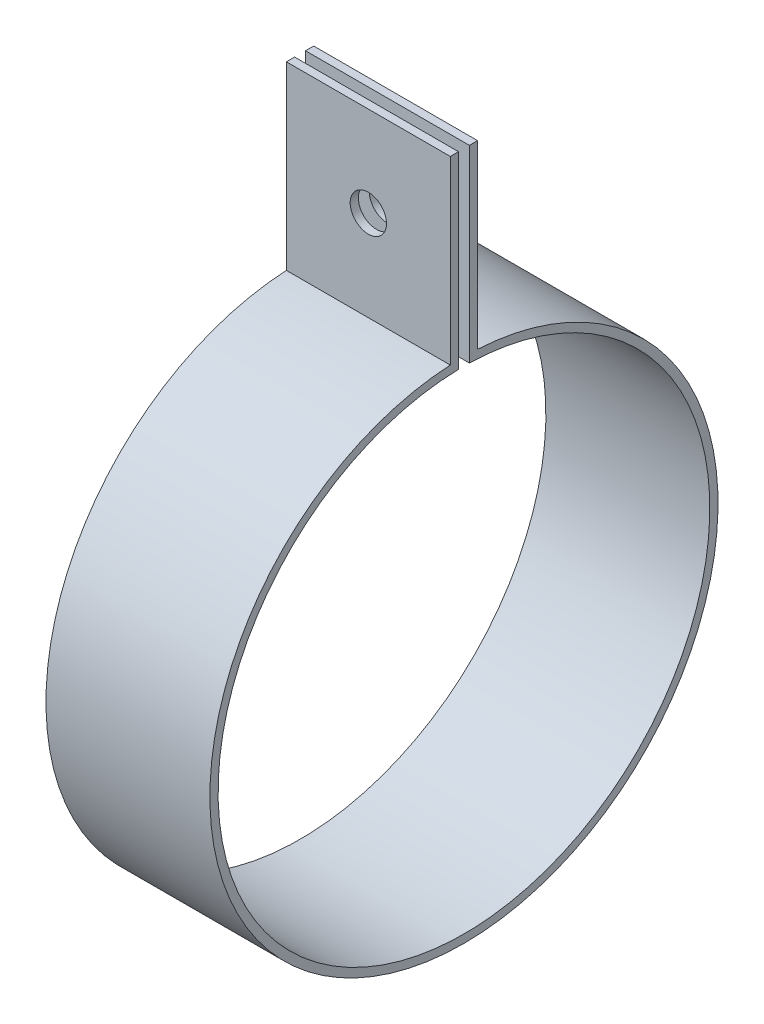
ISO-10303-21;
HEADER;
FILE_DESCRIPTION(('STEP AP214'),'2;1');
FILE_NAME('part.step','',(''),(''),'','','');
FILE_SCHEMA(('AUTOMOTIVE_DESIGN { 1 0 10303 214 1 1 1 1 }'));
ENDSEC;
DATA;
#1=APPLICATION_CONTEXT('core data for automotive mechanical design processes');
#2=APPLICATION_PROTOCOL_DEFINITION('international standard','automotive_design',2000,#1);
#3=PRODUCT_CONTEXT('',#1,'mechanical');
#4=PRODUCT('Part','Part','',(#3));
#5=PRODUCT_RELATED_PRODUCT_CATEGORY('part','',(#4));
#6=PRODUCT_DEFINITION_FORMATION('','',#4);
#7=PRODUCT_DEFINITION_CONTEXT('part definition',#1,'design');
#8=PRODUCT_DEFINITION('design','',#6,#7);
#9=PRODUCT_DEFINITION_SHAPE('','',#8);
#10=(LENGTH_UNIT() NAMED_UNIT(*) SI_UNIT(.MILLI.,.METRE.));
#11=(NAMED_UNIT(*) PLANE_ANGLE_UNIT() SI_UNIT($,.RADIAN.));
#12=(NAMED_UNIT(*) SI_UNIT($,.STERADIAN.) SOLID_ANGLE_UNIT());
#13=UNCERTAINTY_MEASURE_WITH_UNIT(LENGTH_MEASURE(1.E-05),#10,'distance_accuracy_value','');
#14=(GEOMETRIC_REPRESENTATION_CONTEXT(3) GLOBAL_UNCERTAINTY_ASSIGNED_CONTEXT((#13)) GLOBAL_UNIT_ASSIGNED_CONTEXT((#10,
#11,#12)) REPRESENTATION_CONTEXT('',''));
#15=CARTESIAN_POINT('',(0.,0.,0.));
#16=DIRECTION('',(0.,0.,1.));
#17=DIRECTION('',(1.,0.,0.));
#18=AXIS2_PLACEMENT_3D('',#15,#16,#17);
#19=CARTESIAN_POINT('',(0.,14.9925494902559,0.));
#20=DIRECTION('',(1.,0.,0.));
#21=DIRECTION('',(0.,1.,0.));
#22=AXIS2_PLACEMENT_3D('',#19,#20,#21);
#23=PLANE('',#22);
#24=DIRECTION('',(0.,0.,1.));
#25=VECTOR('',#24,1.);
#26=CARTESIAN_POINT('',(0.,79.5,1.));
#27=LINE('',#26,#25);
#28=CARTESIAN_POINT('',(0.,79.5,1.));
#29=VERTEX_POINT('',#28);
#30=CARTESIAN_POINT('',(0.,79.5,2.5));
#31=VERTEX_POINT('',#30);
#32=EDGE_CURVE('E27',#29,#31,#27,.T.);
#33=ORIENTED_EDGE('',*,*,#32,.F.);
#34=DIRECTION('',(0.,1.,0.));
#35=VECTOR('',#34,1.);
#36=CARTESIAN_POINT('',(0.,44.988887516808,1.));
#37=LINE('',#36,#35);
#38=CARTESIAN_POINT('',(0.,44.988887516808,1.));
#39=VERTEX_POINT('',#38);
#40=EDGE_CURVE('E140',#39,#29,#37,.T.);
#41=ORIENTED_EDGE('',*,*,#40,.F.);
#42=CARTESIAN_POINT('',(0.,0.,0.));
#43=DIRECTION('',(-1.,0.,0.));
#44=DIRECTION('',(0.,-1.,0.));
#45=AXIS2_PLACEMENT_3D('',#42,#43,#44);
#46=CIRCLE('',#45,45.);
#47=CARTESIAN_POINT('',(0.,44.988887516808,-1.));
#48=VERTEX_POINT('',#47);
#49=EDGE_CURVE('E164',#48,#39,#46,.T.);
#50=ORIENTED_EDGE('',*,*,#49,.F.);
#51=DIRECTION('',(0.,-1.,0.));
#52=VECTOR('',#51,1.);
#53=CARTESIAN_POINT('',(0.,79.5,-1.));
#54=LINE('',#53,#52);
#55=CARTESIAN_POINT('',(0.,79.5,-1.));
#56=VERTEX_POINT('',#55);
#57=EDGE_CURVE('E156',#56,#48,#54,.T.);
#58=ORIENTED_EDGE('',*,*,#57,.F.);
#59=DIRECTION('',(0.,0.,1.));
#60=VECTOR('',#59,1.);
#61=CARTESIAN_POINT('',(0.,79.5,-2.5));
#62=LINE('',#61,#60);
#63=CARTESIAN_POINT('',(0.,79.5,-2.5));
#64=VERTEX_POINT('',#63);
#65=EDGE_CURVE('E107',#64,#56,#62,.T.);
#66=ORIENTED_EDGE('',*,*,#65,.F.);
#67=DIRECTION('',(0.,1.,0.));
#68=VECTOR('',#67,1.);
#69=CARTESIAN_POINT('',(0.,46.4327470649756,-2.49999999999984));
#70=LINE('',#69,#68);
#71=CARTESIAN_POINT('',(0.,46.4327470649756,-2.49999999999984));
#72=VERTEX_POINT('',#71);
#73=EDGE_CURVE('E123',#72,#64,#70,.T.);
#74=ORIENTED_EDGE('',*,*,#73,.F.);
#75=CARTESIAN_POINT('',(0.,0.,0.));
#76=DIRECTION('',(1.,0.,0.));
#77=DIRECTION('',(0.,0.998553700322056,0.053763440860215));
#78=AXIS2_PLACEMENT_3D('',#75,#76,#77);
#79=CIRCLE('',#78,46.5);
#80=CARTESIAN_POINT('',(0.,46.4327470649756,2.5));
#81=VERTEX_POINT('',#80);
#82=EDGE_CURVE('E177',#81,#72,#79,.T.);
#83=ORIENTED_EDGE('',*,*,#82,.F.);
#84=DIRECTION('',(0.,-1.,0.));
#85=VECTOR('',#84,1.);
#86=CARTESIAN_POINT('',(0.,79.5,2.5));
#87=LINE('',#86,#85);
#88=EDGE_CURVE('E153',#31,#81,#87,.T.);
#89=ORIENTED_EDGE('',*,*,#88,.F.);
#90=EDGE_LOOP('',(#33,#41,#50,#58,#66,#74,#83,#89));
#91=FACE_BOUND('',#90,.T.);
#92=ADVANCED_FACE('F16',(#91),#23,.F.);
#93=CARTESIAN_POINT('',(30.,14.9925494902559,0.));
#94=DIRECTION('',(1.,0.,0.));
#95=DIRECTION('',(0.,1.,0.));
#96=AXIS2_PLACEMENT_3D('',#93,#94,#95);
#97=PLANE('',#96);
#98=DIRECTION('',(0.,0.,1.));
#99=VECTOR('',#98,1.);
#100=CARTESIAN_POINT('',(30.,79.5,1.));
#101=LINE('',#100,#99);
#102=CARTESIAN_POINT('',(30.,79.5,1.));
#103=VERTEX_POINT('',#102);
#104=CARTESIAN_POINT('',(30.,79.5,2.5));
#105=VERTEX_POINT('',#104);
#106=EDGE_CURVE('E11',#103,#105,#101,.T.);
#107=ORIENTED_EDGE('',*,*,#106,.T.);
#108=DIRECTION('',(0.,-1.,0.));
#109=VECTOR('',#108,1.);
#110=CARTESIAN_POINT('',(30.,79.5,2.5));
#111=LINE('',#110,#109);
#112=CARTESIAN_POINT('',(30.,46.4327470649756,2.5));
#113=VERTEX_POINT('',#112);
#114=EDGE_CURVE('E171',#105,#113,#111,.T.);
#115=ORIENTED_EDGE('',*,*,#114,.T.);
#116=CARTESIAN_POINT('',(30.,0.,0.));
#117=DIRECTION('',(1.,0.,0.));
#118=DIRECTION('',(0.,0.998553700322056,0.053763440860215));
#119=AXIS2_PLACEMENT_3D('',#116,#117,#118);
#120=CIRCLE('',#119,46.5);
#121=CARTESIAN_POINT('',(30.,46.4327470649756,-2.49999999999984));
#122=VERTEX_POINT('',#121);
#123=EDGE_CURVE('E154',#113,#122,#120,.T.);
#124=ORIENTED_EDGE('',*,*,#123,.T.);
#125=DIRECTION('',(0.,1.,0.));
#126=VECTOR('',#125,1.);
#127=CARTESIAN_POINT('',(30.,46.4327470649756,-2.49999999999984));
#128=LINE('',#127,#126);
#129=CARTESIAN_POINT('',(30.,79.5,-2.5));
#130=VERTEX_POINT('',#129);
#131=EDGE_CURVE('E146',#122,#130,#128,.T.);
#132=ORIENTED_EDGE('',*,*,#131,.T.);
#133=DIRECTION('',(0.,0.,1.));
#134=VECTOR('',#133,1.);
#135=CARTESIAN_POINT('',(30.,79.5,-2.5));
#136=LINE('',#135,#134);
#137=CARTESIAN_POINT('',(30.,79.5,-1.));
#138=VERTEX_POINT('',#137);
#139=EDGE_CURVE('E20',#130,#138,#136,.T.);
#140=ORIENTED_EDGE('',*,*,#139,.T.);
#141=DIRECTION('',(0.,-1.,0.));
#142=VECTOR('',#141,1.);
#143=CARTESIAN_POINT('',(30.,79.5,-1.));
#144=LINE('',#143,#142);
#145=CARTESIAN_POINT('',(30.,44.988887516808,-1.));
#146=VERTEX_POINT('',#145);
#147=EDGE_CURVE('E159',#138,#146,#144,.T.);
#148=ORIENTED_EDGE('',*,*,#147,.T.);
#149=CARTESIAN_POINT('',(30.,0.,0.));
#150=DIRECTION('',(-1.,0.,0.));
#151=DIRECTION('',(0.,-1.,0.));
#152=AXIS2_PLACEMENT_3D('',#149,#150,#151);
#153=CIRCLE('',#152,45.);
#154=CARTESIAN_POINT('',(30.,44.988887516808,1.));
#155=VERTEX_POINT('',#154);
#156=EDGE_CURVE('E167',#146,#155,#153,.T.);
#157=ORIENTED_EDGE('',*,*,#156,.T.);
#158=DIRECTION('',(0.,1.,0.));
#159=VECTOR('',#158,1.);
#160=CARTESIAN_POINT('',(30.,44.988887516808,1.));
#161=LINE('',#160,#159);
#162=EDGE_CURVE('E205',#155,#103,#161,.T.);
#163=ORIENTED_EDGE('',*,*,#162,.T.);
#164=EDGE_LOOP('',(#107,#115,#124,#132,#140,#148,#157,#163));
#165=FACE_BOUND('',#164,.T.);
#166=ADVANCED_FACE('F216',(#165),#97,.T.);
#167=CARTESIAN_POINT('',(0.,79.5,1.));
#168=DIRECTION('',(0.,1.,0.));
#169=DIRECTION('',(1.,0.,0.));
#170=AXIS2_PLACEMENT_3D('',#167,#168,#169);
#171=PLANE('',#170);
#172=ORIENTED_EDGE('',*,*,#32,.T.);
#173=DIRECTION('',(1.,0.,0.));
#174=VECTOR('',#173,1.);
#175=CARTESIAN_POINT('',(0.,79.5,2.5));
#176=LINE('',#175,#174);
#177=EDGE_CURVE('E174',#31,#105,#176,.T.);
#178=ORIENTED_EDGE('',*,*,#177,.T.);
#179=ORIENTED_EDGE('',*,*,#106,.F.);
#180=DIRECTION('',(1.,0.,0.));
#181=VECTOR('',#180,1.);
#182=CARTESIAN_POINT('',(0.,79.5,1.));
#183=LINE('',#182,#181);
#184=EDGE_CURVE('E201',#29,#103,#183,.T.);
#185=ORIENTED_EDGE('',*,*,#184,.F.);
#186=EDGE_LOOP('',(#172,#178,#179,#185));
#187=FACE_BOUND('',#186,.T.);
#188=ADVANCED_FACE('F223',(#187),#171,.T.);
#189=CARTESIAN_POINT('',(0.,79.5,2.5));
#190=DIRECTION('',(0.,0.,1.));
#191=DIRECTION('',(1.,0.,0.));
#192=AXIS2_PLACEMENT_3D('',#189,#190,#191);
#193=PLANE('',#192);
#194=ORIENTED_EDGE('',*,*,#88,.T.);
#195=DIRECTION('',(1.,0.,0.));
#196=VECTOR('',#195,1.);
#197=CARTESIAN_POINT('',(0.,46.4327470649756,2.5));
#198=LINE('',#197,#196);
#199=EDGE_CURVE('E150',#81,#113,#198,.T.);
#200=ORIENTED_EDGE('',*,*,#199,.T.);
#201=ORIENTED_EDGE('',*,*,#114,.F.);
#202=ORIENTED_EDGE('',*,*,#177,.F.);
#203=EDGE_LOOP('',(#194,#200,#201,#202));
#204=FACE_BOUND('',#203,.T.);
#205=CARTESIAN_POINT('',(15.,63.,2.5));
#206=DIRECTION('',(0.,0.,-1.));
#207=DIRECTION('',(1.,0.,0.));
#208=AXIS2_PLACEMENT_3D('',#205,#206,#207);
#209=CIRCLE('',#208,3.3235);
#210=CARTESIAN_POINT('',(18.3235,63.,2.5));
#211=VERTEX_POINT('',#210);
#212=EDGE_CURVE('E132',#211,#211,#209,.T.);
#213=ORIENTED_EDGE('',*,*,#212,.T.);
#214=EDGE_LOOP('',(#213));
#215=FACE_BOUND('',#214,.T.);
#216=ADVANCED_FACE('F228',(#204,#215),#193,.T.);
#217=CARTESIAN_POINT('',(0.,0.,0.));
#218=DIRECTION('',(1.,0.,0.));
#219=DIRECTION('',(0.,0.998553700322056,0.053763440860215));
#220=AXIS2_PLACEMENT_3D('',#217,#218,#219);
#221=CYLINDRICAL_SURFACE('',#220,46.5);
#222=ORIENTED_EDGE('',*,*,#82,.T.);
#223=DIRECTION('',(1.,0.,0.));
#224=VECTOR('',#223,1.);
#225=CARTESIAN_POINT('',(0.,46.4327470649756,-2.49999999999984));
#226=LINE('',#225,#224);
#227=EDGE_CURVE('E149',#72,#122,#226,.T.);
#228=ORIENTED_EDGE('',*,*,#227,.T.);
#229=ORIENTED_EDGE('',*,*,#123,.F.);
#230=ORIENTED_EDGE('',*,*,#199,.F.);
#231=EDGE_LOOP('',(#222,#228,#229,#230));
#232=FACE_BOUND('',#231,.T.);
#233=ADVANCED_FACE('F234',(#232),#221,.T.);
#234=CARTESIAN_POINT('',(0.,46.4327470649756,-2.49999999999984));
#235=DIRECTION('',(0.,0.,-1.));
#236=DIRECTION('',(0.,-1.,0.));
#237=AXIS2_PLACEMENT_3D('',#234,#235,#236);
#238=PLANE('',#237);
#239=ORIENTED_EDGE('',*,*,#73,.T.);
#240=DIRECTION('',(1.,0.,0.));
#241=VECTOR('',#240,1.);
#242=CARTESIAN_POINT('',(0.,79.5,-2.5));
#243=LINE('',#242,#241);
#244=EDGE_CURVE('E187',#64,#130,#243,.T.);
#245=ORIENTED_EDGE('',*,*,#244,.T.);
#246=ORIENTED_EDGE('',*,*,#131,.F.);
#247=ORIENTED_EDGE('',*,*,#227,.F.);
#248=EDGE_LOOP('',(#239,#245,#246,#247));
#249=FACE_BOUND('',#248,.T.);
#250=CARTESIAN_POINT('',(15.,63.,-2.49999999999984));
#251=DIRECTION('',(0.,0.,1.));
#252=DIRECTION('',(1.,0.,0.));
#253=AXIS2_PLACEMENT_3D('',#250,#251,#252);
#254=CIRCLE('',#253,3.3235);
#255=CARTESIAN_POINT('',(11.6765,63.,-2.49999999999984));
#256=VERTEX_POINT('',#255);
#257=EDGE_CURVE('E142',#256,#256,#254,.T.);
#258=ORIENTED_EDGE('',*,*,#257,.T.);
#259=EDGE_LOOP('',(#258));
#260=FACE_BOUND('',#259,.T.);
#261=ADVANCED_FACE('F236',(#249,#260),#238,.T.);
#262=CARTESIAN_POINT('',(0.,79.5,-2.5));
#263=DIRECTION('',(0.,1.,0.));
#264=DIRECTION('',(1.,0.,0.));
#265=AXIS2_PLACEMENT_3D('',#262,#263,#264);
#266=PLANE('',#265);
#267=ORIENTED_EDGE('',*,*,#65,.T.);
#268=DIRECTION('',(1.,0.,0.));
#269=VECTOR('',#268,1.);
#270=CARTESIAN_POINT('',(0.,79.5,-1.));
#271=LINE('',#270,#269);
#272=EDGE_CURVE('E163',#56,#138,#271,.T.);
#273=ORIENTED_EDGE('',*,*,#272,.T.);
#274=ORIENTED_EDGE('',*,*,#139,.F.);
#275=ORIENTED_EDGE('',*,*,#244,.F.);
#276=EDGE_LOOP('',(#267,#273,#274,#275));
#277=FACE_BOUND('',#276,.T.);
#278=ADVANCED_FACE('F239',(#277),#266,.T.);
#279=CARTESIAN_POINT('',(0.,79.5,-1.));
#280=DIRECTION('',(0.,0.,1.));
#281=DIRECTION('',(1.,0.,0.));
#282=AXIS2_PLACEMENT_3D('',#279,#280,#281);
#283=PLANE('',#282);
#284=ORIENTED_EDGE('',*,*,#57,.T.);
#285=DIRECTION('',(1.,0.,0.));
#286=VECTOR('',#285,1.);
#287=CARTESIAN_POINT('',(0.,44.988887516808,-1.));
#288=LINE('',#287,#286);
#289=EDGE_CURVE('E160',#48,#146,#288,.T.);
#290=ORIENTED_EDGE('',*,*,#289,.T.);
#291=ORIENTED_EDGE('',*,*,#147,.F.);
#292=ORIENTED_EDGE('',*,*,#272,.F.);
#293=EDGE_LOOP('',(#284,#290,#291,#292));
#294=FACE_BOUND('',#293,.T.);
#295=CARTESIAN_POINT('',(15.,63.,-1.));
#296=DIRECTION('',(0.,0.,-1.));
#297=DIRECTION('',(1.,0.,0.));
#298=AXIS2_PLACEMENT_3D('',#295,#296,#297);
#299=CIRCLE('',#298,3.3235);
#300=CARTESIAN_POINT('',(11.6765,63.,-1.));
#301=VERTEX_POINT('',#300);
#302=EDGE_CURVE('E133',#301,#301,#299,.T.);
#303=ORIENTED_EDGE('',*,*,#302,.T.);
#304=EDGE_LOOP('',(#303));
#305=FACE_BOUND('',#304,.T.);
#306=ADVANCED_FACE('F359',(#294,#305),#283,.T.);
#307=CARTESIAN_POINT('',(0.,0.,0.));
#308=DIRECTION('',(1.,0.,0.));
#309=DIRECTION('',(0.,-1.,0.));
#310=AXIS2_PLACEMENT_3D('',#307,#308,#309);
#311=CYLINDRICAL_SURFACE('',#310,45.);
#312=ORIENTED_EDGE('',*,*,#49,.T.);
#313=DIRECTION('',(1.,0.,0.));
#314=VECTOR('',#313,1.);
#315=CARTESIAN_POINT('',(0.,44.988887516808,1.));
#316=LINE('',#315,#314);
#317=EDGE_CURVE('E168',#39,#155,#316,.T.);
#318=ORIENTED_EDGE('',*,*,#317,.T.);
#319=ORIENTED_EDGE('',*,*,#156,.F.);
#320=ORIENTED_EDGE('',*,*,#289,.F.);
#321=EDGE_LOOP('',(#312,#318,#319,#320));
#322=FACE_BOUND('',#321,.T.);
#323=ADVANCED_FACE('F349',(#322),#311,.F.);
#324=CARTESIAN_POINT('',(0.,44.988887516808,1.));
#325=DIRECTION('',(0.,0.,-1.));
#326=DIRECTION('',(0.,-1.,0.));
#327=AXIS2_PLACEMENT_3D('',#324,#325,#326);
#328=PLANE('',#327);
#329=ORIENTED_EDGE('',*,*,#40,.T.);
#330=ORIENTED_EDGE('',*,*,#184,.T.);
#331=ORIENTED_EDGE('',*,*,#162,.F.);
#332=ORIENTED_EDGE('',*,*,#317,.F.);
#333=EDGE_LOOP('',(#329,#330,#331,#332));
#334=FACE_BOUND('',#333,.T.);
#335=CARTESIAN_POINT('',(15.,63.,1.));
#336=DIRECTION('',(0.,0.,1.));
#337=DIRECTION('',(1.,0.,0.));
#338=AXIS2_PLACEMENT_3D('',#335,#336,#337);
#339=CIRCLE('',#338,3.3235);
#340=CARTESIAN_POINT('',(11.6765,63.,1.));
#341=VERTEX_POINT('',#340);
#342=EDGE_CURVE('E128',#341,#341,#339,.T.);
#343=ORIENTED_EDGE('',*,*,#342,.T.);
#344=EDGE_LOOP('',(#343));
#345=FACE_BOUND('',#344,.T.);
#346=ADVANCED_FACE('F129',(#334,#345),#328,.T.);
#347=CARTESIAN_POINT('',(15.,63.,-156.95218719102));
#348=DIRECTION('',(0.,0.,1.));
#349=DIRECTION('',(1.,0.,0.));
#350=AXIS2_PLACEMENT_3D('',#347,#348,#349);
#351=CYLINDRICAL_SURFACE('',#350,3.3235);
#352=ORIENTED_EDGE('',*,*,#212,.F.);
#353=EDGE_LOOP('',(#352));
#354=FACE_BOUND('',#353,.T.);
#355=ORIENTED_EDGE('',*,*,#342,.F.);
#356=EDGE_LOOP('',(#355));
#357=FACE_BOUND('',#356,.T.);
#358=ADVANCED_FACE('F326',(#354,#357),#351,.F.);
#359=CARTESIAN_POINT('',(15.,63.,-156.95218719102));
#360=DIRECTION('',(0.,0.,1.));
#361=DIRECTION('',(1.,0.,0.));
#362=AXIS2_PLACEMENT_3D('',#359,#360,#361);
#363=CYLINDRICAL_SURFACE('',#362,3.3235);
#364=ORIENTED_EDGE('',*,*,#302,.F.);
#365=EDGE_LOOP('',(#364));
#366=FACE_BOUND('',#365,.T.);
#367=ORIENTED_EDGE('',*,*,#257,.F.);
#368=EDGE_LOOP('',(#367));
#369=FACE_BOUND('',#368,.T.);
#370=ADVANCED_FACE('F18',(#366,#369),#363,.F.);
#371=CLOSED_SHELL('',(#92,#166,#188,#216,#233,#261,#278,#306,#323,#346,#358,#370));
#372=MANIFOLD_SOLID_BREP('B1',#371);
#373=ADVANCED_BREP_SHAPE_REPRESENTATION('',(#18,#372),#14);
#374=SHAPE_DEFINITION_REPRESENTATION(#9,#373);
ENDSEC;
END-ISO-10303-21;
